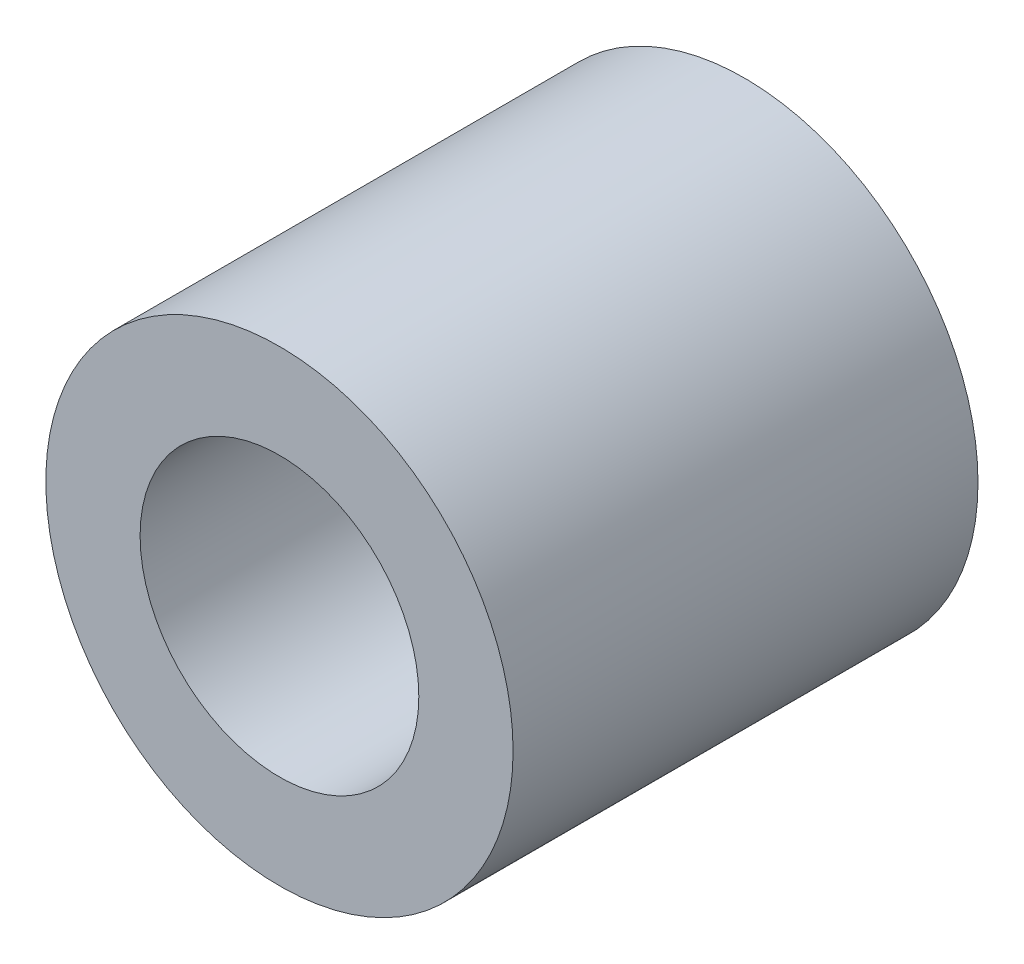
ISO-10303-21;
HEADER;
FILE_DESCRIPTION(('STEP AP214'),'2;1');
FILE_NAME('part.step','',(''),(''),'','','');
FILE_SCHEMA(('AUTOMOTIVE_DESIGN { 1 0 10303 214 1 1 1 1 }'));
ENDSEC;
DATA;
#1=APPLICATION_CONTEXT('core data for automotive mechanical design processes');
#2=APPLICATION_PROTOCOL_DEFINITION('international standard','automotive_design',2000,#1);
#3=PRODUCT_CONTEXT('',#1,'mechanical');
#4=PRODUCT('Part','Part','',(#3));
#5=PRODUCT_RELATED_PRODUCT_CATEGORY('part','',(#4));
#6=PRODUCT_DEFINITION_FORMATION('','',#4);
#7=PRODUCT_DEFINITION_CONTEXT('part definition',#1,'design');
#8=PRODUCT_DEFINITION('design','',#6,#7);
#9=PRODUCT_DEFINITION_SHAPE('','',#8);
#10=(LENGTH_UNIT() NAMED_UNIT(*) SI_UNIT(.MILLI.,.METRE.));
#11=(NAMED_UNIT(*) PLANE_ANGLE_UNIT() SI_UNIT($,.RADIAN.));
#12=(NAMED_UNIT(*) SI_UNIT($,.STERADIAN.) SOLID_ANGLE_UNIT());
#13=UNCERTAINTY_MEASURE_WITH_UNIT(LENGTH_MEASURE(1.E-05),#10,'distance_accuracy_value','');
#14=(GEOMETRIC_REPRESENTATION_CONTEXT(3) GLOBAL_UNCERTAINTY_ASSIGNED_CONTEXT((#13)) GLOBAL_UNIT_ASSIGNED_CONTEXT((#10,
#11,#12)) REPRESENTATION_CONTEXT('',''));
#15=CARTESIAN_POINT('',(0.,0.,0.));
#16=DIRECTION('',(0.,0.,1.));
#17=DIRECTION('',(1.,0.,0.));
#18=AXIS2_PLACEMENT_3D('',#15,#16,#17);
#19=CARTESIAN_POINT('',(0.,0.,20.));
#20=DIRECTION('',(0.,0.,1.));
#21=DIRECTION('',(1.,0.,0.));
#22=AXIS2_PLACEMENT_3D('',#19,#20,#21);
#23=PLANE('',#22);
#24=CARTESIAN_POINT('',(0.,0.,20.));
#25=DIRECTION('',(0.,0.,1.));
#26=DIRECTION('',(1.,0.,0.));
#27=AXIS2_PLACEMENT_3D('',#24,#25,#26);
#28=CIRCLE('',#27,10.05);
#29=CARTESIAN_POINT('',(10.05,0.,20.));
#30=VERTEX_POINT('',#29);
#31=EDGE_CURVE('E10',#30,#30,#28,.T.);
#32=ORIENTED_EDGE('',*,*,#31,.T.);
#33=EDGE_LOOP('',(#32));
#34=FACE_BOUND('',#33,.T.);
#35=CARTESIAN_POINT('',(0.,0.,20.));
#36=DIRECTION('',(0.,0.,1.));
#37=DIRECTION('',(1.,0.,0.));
#38=AXIS2_PLACEMENT_3D('',#35,#36,#37);
#39=CIRCLE('',#38,5.995);
#40=CARTESIAN_POINT('',(5.995,0.,20.));
#41=VERTEX_POINT('',#40);
#42=EDGE_CURVE('E42',#41,#41,#39,.T.);
#43=ORIENTED_EDGE('',*,*,#42,.F.);
#44=EDGE_LOOP('',(#43));
#45=FACE_BOUND('',#44,.T.);
#46=ADVANCED_FACE('F31',(#34,#45),#23,.T.);
#47=CARTESIAN_POINT('',(0.,0.,0.));
#48=DIRECTION('',(0.,0.,1.));
#49=DIRECTION('',(1.,0.,0.));
#50=AXIS2_PLACEMENT_3D('',#47,#48,#49);
#51=PLANE('',#50);
#52=CARTESIAN_POINT('',(0.,0.,0.));
#53=DIRECTION('',(0.,0.,1.));
#54=DIRECTION('',(1.,0.,0.));
#55=AXIS2_PLACEMENT_3D('',#52,#53,#54);
#56=CIRCLE('',#55,10.05);
#57=CARTESIAN_POINT('',(10.05,0.,0.));
#58=VERTEX_POINT('',#57);
#59=EDGE_CURVE('E35',#58,#58,#56,.T.);
#60=ORIENTED_EDGE('',*,*,#59,.F.);
#61=EDGE_LOOP('',(#60));
#62=FACE_BOUND('',#61,.T.);
#63=CARTESIAN_POINT('',(0.,0.,0.));
#64=DIRECTION('',(0.,0.,1.));
#65=DIRECTION('',(1.,0.,0.));
#66=AXIS2_PLACEMENT_3D('',#63,#64,#65);
#67=CIRCLE('',#66,5.995);
#68=CARTESIAN_POINT('',(5.995,0.,0.));
#69=VERTEX_POINT('',#68);
#70=EDGE_CURVE('E44',#69,#69,#67,.T.);
#71=ORIENTED_EDGE('',*,*,#70,.T.);
#72=EDGE_LOOP('',(#71));
#73=FACE_BOUND('',#72,.T.);
#74=ADVANCED_FACE('F54',(#62,#73),#51,.F.);
#75=CARTESIAN_POINT('',(0.,0.,20.));
#76=DIRECTION('',(0.,0.,-1.));
#77=DIRECTION('',(-1.,0.,0.));
#78=AXIS2_PLACEMENT_3D('',#75,#76,#77);
#79=CYLINDRICAL_SURFACE('',#78,10.05);
#80=ORIENTED_EDGE('',*,*,#31,.F.);
#81=EDGE_LOOP('',(#80));
#82=FACE_BOUND('',#81,.T.);
#83=ORIENTED_EDGE('',*,*,#59,.T.);
#84=EDGE_LOOP('',(#83));
#85=FACE_BOUND('',#84,.T.);
#86=ADVANCED_FACE('F33',(#82,#85),#79,.T.);
#87=CARTESIAN_POINT('',(0.,0.,20.));
#88=DIRECTION('',(0.,0.,-1.));
#89=DIRECTION('',(-1.,0.,0.));
#90=AXIS2_PLACEMENT_3D('',#87,#88,#89);
#91=CYLINDRICAL_SURFACE('',#90,5.995);
#92=ORIENTED_EDGE('',*,*,#42,.T.);
#93=EDGE_LOOP('',(#92));
#94=FACE_BOUND('',#93,.T.);
#95=ORIENTED_EDGE('',*,*,#70,.F.);
#96=EDGE_LOOP('',(#95));
#97=FACE_BOUND('',#96,.T.);
#98=ADVANCED_FACE('F50',(#94,#97),#91,.F.);
#99=CLOSED_SHELL('',(#46,#74,#86,#98));
#100=MANIFOLD_SOLID_BREP('B2',#99);
#101=ADVANCED_BREP_SHAPE_REPRESENTATION('',(#18,#100),#14);
#102=SHAPE_DEFINITION_REPRESENTATION(#9,#101);
ENDSEC;
END-ISO-10303-21;
